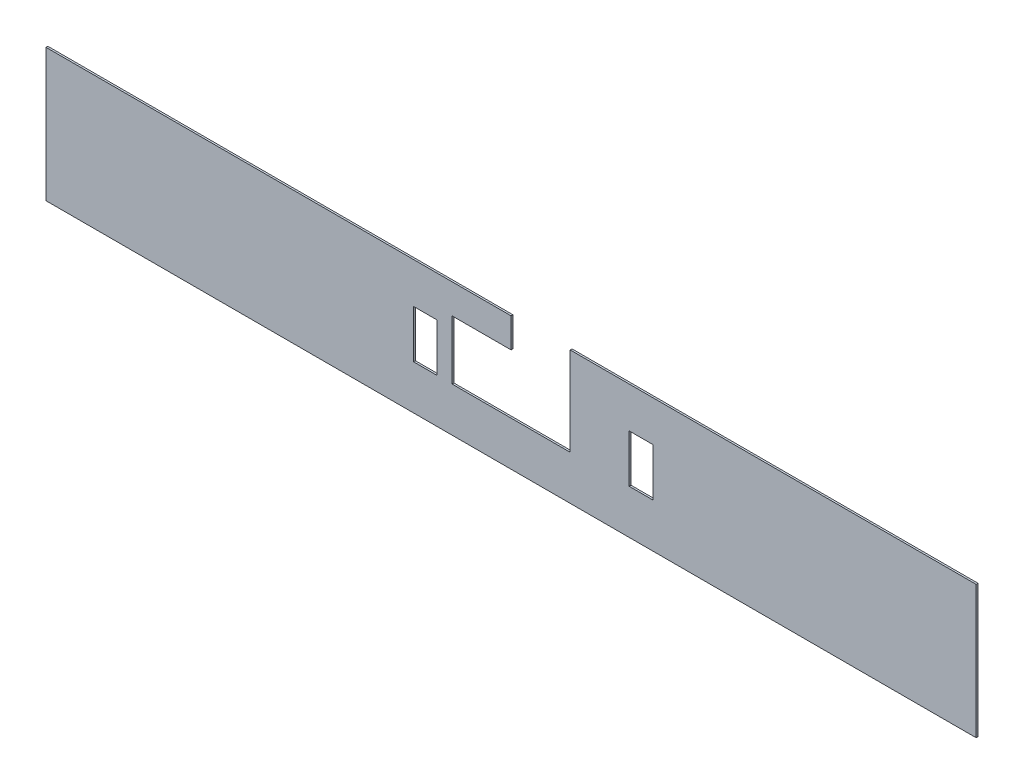
ISO-10303-21;
HEADER;
FILE_DESCRIPTION(('STEP AP214'),'2;1');
FILE_NAME('part.step','',(''),(''),'','','');
FILE_SCHEMA(('AUTOMOTIVE_DESIGN { 1 0 10303 214 1 1 1 1 }'));
ENDSEC;
DATA;
#1=APPLICATION_CONTEXT('core data for automotive mechanical design processes');
#2=APPLICATION_PROTOCOL_DEFINITION('international standard','automotive_design',2000,#1);
#3=PRODUCT_CONTEXT('',#1,'mechanical');
#4=PRODUCT('Part','Part','',(#3));
#5=PRODUCT_RELATED_PRODUCT_CATEGORY('part','',(#4));
#6=PRODUCT_DEFINITION_FORMATION('','',#4);
#7=PRODUCT_DEFINITION_CONTEXT('part definition',#1,'design');
#8=PRODUCT_DEFINITION('design','',#6,#7);
#9=PRODUCT_DEFINITION_SHAPE('','',#8);
#10=(LENGTH_UNIT() NAMED_UNIT(*) SI_UNIT(.MILLI.,.METRE.));
#11=(NAMED_UNIT(*) PLANE_ANGLE_UNIT() SI_UNIT($,.RADIAN.));
#12=(NAMED_UNIT(*) SI_UNIT($,.STERADIAN.) SOLID_ANGLE_UNIT());
#13=UNCERTAINTY_MEASURE_WITH_UNIT(LENGTH_MEASURE(1.E-05),#10,'distance_accuracy_value','');
#14=(GEOMETRIC_REPRESENTATION_CONTEXT(3) GLOBAL_UNCERTAINTY_ASSIGNED_CONTEXT((#13)) GLOBAL_UNIT_ASSIGNED_CONTEXT((#10,
#11,#12)) REPRESENTATION_CONTEXT('',''));
#15=CARTESIAN_POINT('',(0.,0.,0.));
#16=DIRECTION('',(0.,0.,1.));
#17=DIRECTION('',(1.,0.,0.));
#18=AXIS2_PLACEMENT_3D('',#15,#16,#17);
#19=CARTESIAN_POINT('',(0.,0.,1.6002));
#20=DIRECTION('',(0.,0.,1.));
#21=DIRECTION('',(1.,0.,0.));
#22=AXIS2_PLACEMENT_3D('',#19,#20,#21);
#23=PLANE('',#22);
#24=DIRECTION('',(-1.,0.,0.));
#25=VECTOR('',#24,1.);
#26=CARTESIAN_POINT('',(0.,50.8,1.6002));
#27=LINE('',#26,#25);
#28=CARTESIAN_POINT('',(0.,50.8,1.6002));
#29=VERTEX_POINT('',#28);
#30=CARTESIAN_POINT('',(-50.8,50.8,1.6002));
#31=VERTEX_POINT('',#30);
#32=EDGE_CURVE('E191',#29,#31,#27,.T.);
#33=ORIENTED_EDGE('',*,*,#32,.F.);
#34=DIRECTION('',(0.,-1.,0.));
#35=VECTOR('',#34,1.);
#36=CARTESIAN_POINT('',(0.,76.2,1.6002));
#37=LINE('',#36,#35);
#38=CARTESIAN_POINT('',(0.,76.2,1.6002));
#39=VERTEX_POINT('',#38);
#40=EDGE_CURVE('E271',#39,#29,#37,.T.);
#41=ORIENTED_EDGE('',*,*,#40,.F.);
#42=DIRECTION('',(1.,0.,0.));
#43=VECTOR('',#42,1.);
#44=CARTESIAN_POINT('',(-400.05,76.2,1.6002));
#45=LINE('',#44,#43);
#46=CARTESIAN_POINT('',(-400.05,76.2,1.6002));
#47=VERTEX_POINT('',#46);
#48=EDGE_CURVE('E268',#47,#39,#45,.T.);
#49=ORIENTED_EDGE('',*,*,#48,.F.);
#50=DIRECTION('',(0.,1.,0.));
#51=VECTOR('',#50,1.);
#52=CARTESIAN_POINT('',(-400.05,-38.1000000000001,1.6002));
#53=LINE('',#52,#51);
#54=CARTESIAN_POINT('',(-400.05,-38.1000000000001,1.6002));
#55=VERTEX_POINT('',#54);
#56=EDGE_CURVE('E265',#55,#47,#53,.T.);
#57=ORIENTED_EDGE('',*,*,#56,.F.);
#58=DIRECTION('',(-1.,0.,0.));
#59=VECTOR('',#58,1.);
#60=CARTESIAN_POINT('',(400.05,-38.1,1.6002));
#61=LINE('',#60,#59);
#62=CARTESIAN_POINT('',(400.05,-38.1,1.6002));
#63=VERTEX_POINT('',#62);
#64=EDGE_CURVE('E262',#63,#55,#61,.T.);
#65=ORIENTED_EDGE('',*,*,#64,.F.);
#66=DIRECTION('',(0.,-1.,0.));
#67=VECTOR('',#66,1.);
#68=CARTESIAN_POINT('',(400.05,76.2,1.6002));
#69=LINE('',#68,#67);
#70=CARTESIAN_POINT('',(400.05,76.2,1.6002));
#71=VERTEX_POINT('',#70);
#72=EDGE_CURVE('E259',#71,#63,#69,.T.);
#73=ORIENTED_EDGE('',*,*,#72,.F.);
#74=DIRECTION('',(1.,0.,0.));
#75=VECTOR('',#74,1.);
#76=CARTESIAN_POINT('',(50.8,76.2,1.6002));
#77=LINE('',#76,#75);
#78=CARTESIAN_POINT('',(50.8,76.2,1.6002));
#79=VERTEX_POINT('',#78);
#80=EDGE_CURVE('E256',#79,#71,#77,.T.);
#81=ORIENTED_EDGE('',*,*,#80,.F.);
#82=DIRECTION('',(0.,1.,0.));
#83=VECTOR('',#82,1.);
#84=CARTESIAN_POINT('',(50.8,0.,1.6002));
#85=LINE('',#84,#83);
#86=CARTESIAN_POINT('',(50.8,0.,1.6002));
#87=VERTEX_POINT('',#86);
#88=EDGE_CURVE('E252',#87,#79,#85,.T.);
#89=ORIENTED_EDGE('',*,*,#88,.F.);
#90=DIRECTION('',(1.,0.,0.));
#91=VECTOR('',#90,1.);
#92=CARTESIAN_POINT('',(0.,0.,1.6002));
#93=LINE('',#92,#91);
#94=CARTESIAN_POINT('',(-50.8,0.,1.6002));
#95=VERTEX_POINT('',#94);
#96=EDGE_CURVE('E250',#95,#87,#93,.T.);
#97=ORIENTED_EDGE('',*,*,#96,.F.);
#98=DIRECTION('',(0.,-1.,0.));
#99=VECTOR('',#98,1.);
#100=CARTESIAN_POINT('',(-50.8,0.,1.6002));
#101=LINE('',#100,#99);
#102=EDGE_CURVE('E181',#31,#95,#101,.T.);
#103=ORIENTED_EDGE('',*,*,#102,.F.);
#104=EDGE_LOOP('',(#33,#41,#49,#57,#65,#73,#81,#89,#97,#103));
#105=FACE_BOUND('',#104,.T.);
#106=DIRECTION('',(-1.,0.,0.));
#107=VECTOR('',#106,1.);
#108=CARTESIAN_POINT('',(-83.82,41.275,1.6002));
#109=LINE('',#108,#107);
#110=CARTESIAN_POINT('',(-63.5,41.275,1.6002));
#111=VERTEX_POINT('',#110);
#112=CARTESIAN_POINT('',(-83.82,41.275,1.6002));
#113=VERTEX_POINT('',#112);
#114=EDGE_CURVE('E223',#111,#113,#109,.T.);
#115=ORIENTED_EDGE('',*,*,#114,.F.);
#116=DIRECTION('',(0.,1.,0.));
#117=VECTOR('',#116,1.);
#118=CARTESIAN_POINT('',(-63.5,41.275,1.6002));
#119=LINE('',#118,#117);
#120=CARTESIAN_POINT('',(-63.5,0.,1.6002));
#121=VERTEX_POINT('',#120);
#122=EDGE_CURVE('E221',#121,#111,#119,.T.);
#123=ORIENTED_EDGE('',*,*,#122,.F.);
#124=DIRECTION('',(1.,0.,0.));
#125=VECTOR('',#124,1.);
#126=CARTESIAN_POINT('',(-83.82,0.,1.6002));
#127=LINE('',#126,#125);
#128=CARTESIAN_POINT('',(-83.82,0.,1.6002));
#129=VERTEX_POINT('',#128);
#130=EDGE_CURVE('E229',#129,#121,#127,.T.);
#131=ORIENTED_EDGE('',*,*,#130,.F.);
#132=DIRECTION('',(0.,-1.,0.));
#133=VECTOR('',#132,1.);
#134=CARTESIAN_POINT('',(-83.82,41.275,1.6002));
#135=LINE('',#134,#133);
#136=EDGE_CURVE('E226',#113,#129,#135,.T.);
#137=ORIENTED_EDGE('',*,*,#136,.F.);
#138=EDGE_LOOP('',(#115,#123,#131,#137));
#139=FACE_BOUND('',#138,.T.);
#140=DIRECTION('',(-1.,0.,0.));
#141=VECTOR('',#140,1.);
#142=CARTESIAN_POINT('',(101.6,41.275,1.6002));
#143=LINE('',#142,#141);
#144=CARTESIAN_POINT('',(121.92,41.275,1.6002));
#145=VERTEX_POINT('',#144);
#146=CARTESIAN_POINT('',(101.6,41.275,1.6002));
#147=VERTEX_POINT('',#146);
#148=EDGE_CURVE('E197',#145,#147,#143,.T.);
#149=ORIENTED_EDGE('',*,*,#148,.F.);
#150=DIRECTION('',(0.,1.,0.));
#151=VECTOR('',#150,1.);
#152=CARTESIAN_POINT('',(121.92,41.275,1.6002));
#153=LINE('',#152,#151);
#154=CARTESIAN_POINT('',(121.92,0.,1.6002));
#155=VERTEX_POINT('',#154);
#156=EDGE_CURVE('E195',#155,#145,#153,.T.);
#157=ORIENTED_EDGE('',*,*,#156,.F.);
#158=DIRECTION('',(1.,0.,0.));
#159=VECTOR('',#158,1.);
#160=CARTESIAN_POINT('',(101.6,0.,1.6002));
#161=LINE('',#160,#159);
#162=CARTESIAN_POINT('',(101.6,0.,1.6002));
#163=VERTEX_POINT('',#162);
#164=EDGE_CURVE('E202',#163,#155,#161,.T.);
#165=ORIENTED_EDGE('',*,*,#164,.F.);
#166=DIRECTION('',(0.,-1.,0.));
#167=VECTOR('',#166,1.);
#168=CARTESIAN_POINT('',(101.6,41.275,1.6002));
#169=LINE('',#168,#167);
#170=EDGE_CURVE('E200',#147,#163,#169,.T.);
#171=ORIENTED_EDGE('',*,*,#170,.F.);
#172=EDGE_LOOP('',(#149,#157,#165,#171));
#173=FACE_BOUND('',#172,.T.);
#174=ADVANCED_FACE('F35',(#105,#139,#173),#23,.T.);
#175=CARTESIAN_POINT('',(0.,0.,0.));
#176=DIRECTION('',(0.,0.,1.));
#177=DIRECTION('',(1.,0.,0.));
#178=AXIS2_PLACEMENT_3D('',#175,#176,#177);
#179=PLANE('',#178);
#180=DIRECTION('',(0.,1.,0.));
#181=VECTOR('',#180,1.);
#182=CARTESIAN_POINT('',(-63.5,41.275,0.));
#183=LINE('',#182,#181);
#184=CARTESIAN_POINT('',(-63.5,0.,0.));
#185=VERTEX_POINT('',#184);
#186=CARTESIAN_POINT('',(-63.5,41.275,0.));
#187=VERTEX_POINT('',#186);
#188=EDGE_CURVE('E220',#185,#187,#183,.T.);
#189=ORIENTED_EDGE('',*,*,#188,.T.);
#190=DIRECTION('',(-1.,0.,0.));
#191=VECTOR('',#190,1.);
#192=CARTESIAN_POINT('',(-83.82,41.275,0.));
#193=LINE('',#192,#191);
#194=CARTESIAN_POINT('',(-83.82,41.275,0.));
#195=VERTEX_POINT('',#194);
#196=EDGE_CURVE('E234',#187,#195,#193,.T.);
#197=ORIENTED_EDGE('',*,*,#196,.T.);
#198=DIRECTION('',(0.,-1.,0.));
#199=VECTOR('',#198,1.);
#200=CARTESIAN_POINT('',(-83.82,41.275,0.));
#201=LINE('',#200,#199);
#202=CARTESIAN_POINT('',(-83.82,0.,0.));
#203=VERTEX_POINT('',#202);
#204=EDGE_CURVE('E237',#195,#203,#201,.T.);
#205=ORIENTED_EDGE('',*,*,#204,.T.);
#206=DIRECTION('',(1.,0.,0.));
#207=VECTOR('',#206,1.);
#208=CARTESIAN_POINT('',(-83.82,0.,0.));
#209=LINE('',#208,#207);
#210=EDGE_CURVE('E224',#203,#185,#209,.T.);
#211=ORIENTED_EDGE('',*,*,#210,.T.);
#212=EDGE_LOOP('',(#189,#197,#205,#211));
#213=FACE_BOUND('',#212,.T.);
#214=DIRECTION('',(0.,-1.,0.));
#215=VECTOR('',#214,1.);
#216=CARTESIAN_POINT('',(0.,76.2,0.));
#217=LINE('',#216,#215);
#218=CARTESIAN_POINT('',(0.,76.2,0.));
#219=VERTEX_POINT('',#218);
#220=CARTESIAN_POINT('',(0.,50.8,0.));
#221=VERTEX_POINT('',#220);
#222=EDGE_CURVE('E253',#219,#221,#217,.T.);
#223=ORIENTED_EDGE('',*,*,#222,.T.);
#224=DIRECTION('',(1.,0.,0.));
#225=VECTOR('',#224,1.);
#226=CARTESIAN_POINT('',(0.,50.8,0.));
#227=LINE('',#226,#225);
#228=CARTESIAN_POINT('',(-50.8,50.8,0.));
#229=VERTEX_POINT('',#228);
#230=EDGE_CURVE('E183',#229,#221,#227,.T.);
#231=ORIENTED_EDGE('',*,*,#230,.F.);
#232=DIRECTION('',(0.,1.,0.));
#233=VECTOR('',#232,1.);
#234=CARTESIAN_POINT('',(-50.8,0.,0.));
#235=LINE('',#234,#233);
#236=CARTESIAN_POINT('',(-50.8,0.,0.));
#237=VERTEX_POINT('',#236);
#238=EDGE_CURVE('E178',#237,#229,#235,.T.);
#239=ORIENTED_EDGE('',*,*,#238,.F.);
#240=DIRECTION('',(1.,0.,0.));
#241=VECTOR('',#240,1.);
#242=CARTESIAN_POINT('',(0.,0.,0.));
#243=LINE('',#242,#241);
#244=CARTESIAN_POINT('',(50.8,0.,0.));
#245=VERTEX_POINT('',#244);
#246=EDGE_CURVE('E161',#237,#245,#243,.T.);
#247=ORIENTED_EDGE('',*,*,#246,.T.);
#248=DIRECTION('',(0.,1.,0.));
#249=VECTOR('',#248,1.);
#250=CARTESIAN_POINT('',(50.8,0.,0.));
#251=LINE('',#250,#249);
#252=CARTESIAN_POINT('',(50.8,76.2,0.));
#253=VERTEX_POINT('',#252);
#254=EDGE_CURVE('E170',#245,#253,#251,.T.);
#255=ORIENTED_EDGE('',*,*,#254,.T.);
#256=DIRECTION('',(1.,0.,0.));
#257=VECTOR('',#256,1.);
#258=CARTESIAN_POINT('',(50.8,76.2,0.));
#259=LINE('',#258,#257);
#260=CARTESIAN_POINT('',(400.05,76.2,0.));
#261=VERTEX_POINT('',#260);
#262=EDGE_CURVE('E275',#253,#261,#259,.T.);
#263=ORIENTED_EDGE('',*,*,#262,.T.);
#264=DIRECTION('',(0.,-1.,0.));
#265=VECTOR('',#264,1.);
#266=CARTESIAN_POINT('',(400.05,76.2,0.));
#267=LINE('',#266,#265);
#268=CARTESIAN_POINT('',(400.05,-38.1,0.));
#269=VERTEX_POINT('',#268);
#270=EDGE_CURVE('E278',#261,#269,#267,.T.);
#271=ORIENTED_EDGE('',*,*,#270,.T.);
#272=DIRECTION('',(-1.,0.,0.));
#273=VECTOR('',#272,1.);
#274=CARTESIAN_POINT('',(400.05,-38.1,0.));
#275=LINE('',#274,#273);
#276=CARTESIAN_POINT('',(-400.05,-38.1000000000001,0.));
#277=VERTEX_POINT('',#276);
#278=EDGE_CURVE('E281',#269,#277,#275,.T.);
#279=ORIENTED_EDGE('',*,*,#278,.T.);
#280=DIRECTION('',(0.,1.,0.));
#281=VECTOR('',#280,1.);
#282=CARTESIAN_POINT('',(-400.05,-38.1000000000001,0.));
#283=LINE('',#282,#281);
#284=CARTESIAN_POINT('',(-400.05,76.2,0.));
#285=VERTEX_POINT('',#284);
#286=EDGE_CURVE('E284',#277,#285,#283,.T.);
#287=ORIENTED_EDGE('',*,*,#286,.T.);
#288=DIRECTION('',(1.,0.,0.));
#289=VECTOR('',#288,1.);
#290=CARTESIAN_POINT('',(-400.05,76.2,0.));
#291=LINE('',#290,#289);
#292=EDGE_CURVE('E287',#285,#219,#291,.T.);
#293=ORIENTED_EDGE('',*,*,#292,.T.);
#294=EDGE_LOOP('',(#223,#231,#239,#247,#255,#263,#271,#279,#287,#293));
#295=FACE_BOUND('',#294,.T.);
#296=DIRECTION('',(0.,1.,0.));
#297=VECTOR('',#296,1.);
#298=CARTESIAN_POINT('',(121.92,41.275,0.));
#299=LINE('',#298,#297);
#300=CARTESIAN_POINT('',(121.92,0.,0.));
#301=VERTEX_POINT('',#300);
#302=CARTESIAN_POINT('',(121.92,41.275,0.));
#303=VERTEX_POINT('',#302);
#304=EDGE_CURVE('E58',#301,#303,#299,.T.);
#305=ORIENTED_EDGE('',*,*,#304,.T.);
#306=DIRECTION('',(-1.,0.,0.));
#307=VECTOR('',#306,1.);
#308=CARTESIAN_POINT('',(101.6,41.275,0.));
#309=LINE('',#308,#307);
#310=CARTESIAN_POINT('',(101.6,41.275,0.));
#311=VERTEX_POINT('',#310);
#312=EDGE_CURVE('E206',#303,#311,#309,.T.);
#313=ORIENTED_EDGE('',*,*,#312,.T.);
#314=DIRECTION('',(0.,-1.,0.));
#315=VECTOR('',#314,1.);
#316=CARTESIAN_POINT('',(101.6,41.275,0.));
#317=LINE('',#316,#315);
#318=CARTESIAN_POINT('',(101.6,0.,0.));
#319=VERTEX_POINT('',#318);
#320=EDGE_CURVE('E209',#311,#319,#317,.T.);
#321=ORIENTED_EDGE('',*,*,#320,.T.);
#322=DIRECTION('',(1.,0.,0.));
#323=VECTOR('',#322,1.);
#324=CARTESIAN_POINT('',(101.6,0.,0.));
#325=LINE('',#324,#323);
#326=EDGE_CURVE('E198',#319,#301,#325,.T.);
#327=ORIENTED_EDGE('',*,*,#326,.T.);
#328=EDGE_LOOP('',(#305,#313,#321,#327));
#329=FACE_BOUND('',#328,.T.);
#330=ADVANCED_FACE('F186',(#213,#295,#329),#179,.F.);
#331=CARTESIAN_POINT('',(0.,0.,1.6002));
#332=DIRECTION('',(0.,1.,0.));
#333=DIRECTION('',(0.,0.,1.));
#334=AXIS2_PLACEMENT_3D('',#331,#332,#333);
#335=PLANE('',#334);
#336=ORIENTED_EDGE('',*,*,#246,.F.);
#337=DIRECTION('',(0.,0.,-1.));
#338=VECTOR('',#337,1.);
#339=CARTESIAN_POINT('',(-50.8,0.,2.54));
#340=LINE('',#339,#338);
#341=EDGE_CURVE('E164',#95,#237,#340,.T.);
#342=ORIENTED_EDGE('',*,*,#341,.F.);
#343=ORIENTED_EDGE('',*,*,#96,.T.);
#344=DIRECTION('',(0.,0.,-1.));
#345=VECTOR('',#344,1.);
#346=CARTESIAN_POINT('',(50.8,0.,1.6002));
#347=LINE('',#346,#345);
#348=EDGE_CURVE('E165',#87,#245,#347,.T.);
#349=ORIENTED_EDGE('',*,*,#348,.T.);
#350=EDGE_LOOP('',(#336,#342,#343,#349));
#351=FACE_BOUND('',#350,.T.);
#352=ADVANCED_FACE('F37',(#351),#335,.T.);
#353=CARTESIAN_POINT('',(0.,76.2,1.6002));
#354=DIRECTION('',(1.,0.,0.));
#355=DIRECTION('',(0.,1.,0.));
#356=AXIS2_PLACEMENT_3D('',#353,#354,#355);
#357=PLANE('',#356);
#358=DIRECTION('',(0.,0.,1.));
#359=VECTOR('',#358,1.);
#360=CARTESIAN_POINT('',(0.,50.8,1.6002));
#361=LINE('',#360,#359);
#362=EDGE_CURVE('E11',#221,#29,#361,.T.);
#363=ORIENTED_EDGE('',*,*,#362,.F.);
#364=ORIENTED_EDGE('',*,*,#222,.F.);
#365=DIRECTION('',(0.,0.,-1.));
#366=VECTOR('',#365,1.);
#367=CARTESIAN_POINT('',(0.,76.2,1.6002));
#368=LINE('',#367,#366);
#369=EDGE_CURVE('E43',#39,#219,#368,.T.);
#370=ORIENTED_EDGE('',*,*,#369,.F.);
#371=ORIENTED_EDGE('',*,*,#40,.T.);
#372=EDGE_LOOP('',(#363,#364,#370,#371));
#373=FACE_BOUND('',#372,.T.);
#374=ADVANCED_FACE('F325',(#373),#357,.T.);
#375=CARTESIAN_POINT('',(-400.05,76.2,1.6002));
#376=DIRECTION('',(0.,1.,0.));
#377=DIRECTION('',(0.,0.,1.));
#378=AXIS2_PLACEMENT_3D('',#375,#376,#377);
#379=PLANE('',#378);
#380=ORIENTED_EDGE('',*,*,#292,.F.);
#381=DIRECTION('',(0.,0.,-1.));
#382=VECTOR('',#381,1.);
#383=CARTESIAN_POINT('',(-400.05,76.2,1.6002));
#384=LINE('',#383,#382);
#385=EDGE_CURVE('E292',#47,#285,#384,.T.);
#386=ORIENTED_EDGE('',*,*,#385,.F.);
#387=ORIENTED_EDGE('',*,*,#48,.T.);
#388=ORIENTED_EDGE('',*,*,#369,.T.);
#389=EDGE_LOOP('',(#380,#386,#387,#388));
#390=FACE_BOUND('',#389,.T.);
#391=ADVANCED_FACE('F333',(#390),#379,.T.);
#392=CARTESIAN_POINT('',(-400.05,-38.1000000000001,1.6002));
#393=DIRECTION('',(-1.,0.,0.));
#394=DIRECTION('',(0.,0.,1.));
#395=AXIS2_PLACEMENT_3D('',#392,#393,#394);
#396=PLANE('',#395);
#397=ORIENTED_EDGE('',*,*,#286,.F.);
#398=DIRECTION('',(0.,0.,-1.));
#399=VECTOR('',#398,1.);
#400=CARTESIAN_POINT('',(-400.05,-38.1000000000001,1.6002));
#401=LINE('',#400,#399);
#402=EDGE_CURVE('E294',#55,#277,#401,.T.);
#403=ORIENTED_EDGE('',*,*,#402,.F.);
#404=ORIENTED_EDGE('',*,*,#56,.T.);
#405=ORIENTED_EDGE('',*,*,#385,.T.);
#406=EDGE_LOOP('',(#397,#403,#404,#405));
#407=FACE_BOUND('',#406,.T.);
#408=ADVANCED_FACE('F319',(#407),#396,.T.);
#409=CARTESIAN_POINT('',(400.05,-38.1,1.6002));
#410=DIRECTION('',(0.,-1.,0.));
#411=DIRECTION('',(1.,0.,0.));
#412=AXIS2_PLACEMENT_3D('',#409,#410,#411);
#413=PLANE('',#412);
#414=ORIENTED_EDGE('',*,*,#278,.F.);
#415=DIRECTION('',(0.,0.,-1.));
#416=VECTOR('',#415,1.);
#417=CARTESIAN_POINT('',(400.05,-38.1,1.6002));
#418=LINE('',#417,#416);
#419=EDGE_CURVE('E296',#63,#269,#418,.T.);
#420=ORIENTED_EDGE('',*,*,#419,.F.);
#421=ORIENTED_EDGE('',*,*,#64,.T.);
#422=ORIENTED_EDGE('',*,*,#402,.T.);
#423=EDGE_LOOP('',(#414,#420,#421,#422));
#424=FACE_BOUND('',#423,.T.);
#425=ADVANCED_FACE('F315',(#424),#413,.T.);
#426=CARTESIAN_POINT('',(400.05,76.2,1.6002));
#427=DIRECTION('',(1.,0.,0.));
#428=DIRECTION('',(0.,0.,-1.));
#429=AXIS2_PLACEMENT_3D('',#426,#427,#428);
#430=PLANE('',#429);
#431=ORIENTED_EDGE('',*,*,#270,.F.);
#432=DIRECTION('',(0.,0.,-1.));
#433=VECTOR('',#432,1.);
#434=CARTESIAN_POINT('',(400.05,76.2,1.6002));
#435=LINE('',#434,#433);
#436=EDGE_CURVE('E298',#71,#261,#435,.T.);
#437=ORIENTED_EDGE('',*,*,#436,.F.);
#438=ORIENTED_EDGE('',*,*,#72,.T.);
#439=ORIENTED_EDGE('',*,*,#419,.T.);
#440=EDGE_LOOP('',(#431,#437,#438,#439));
#441=FACE_BOUND('',#440,.T.);
#442=ADVANCED_FACE('F311',(#441),#430,.T.);
#443=CARTESIAN_POINT('',(50.8,76.2,1.6002));
#444=DIRECTION('',(0.,1.,0.));
#445=DIRECTION('',(0.,0.,1.));
#446=AXIS2_PLACEMENT_3D('',#443,#444,#445);
#447=PLANE('',#446);
#448=ORIENTED_EDGE('',*,*,#262,.F.);
#449=DIRECTION('',(0.,0.,-1.));
#450=VECTOR('',#449,1.);
#451=CARTESIAN_POINT('',(50.8,76.2,1.6002));
#452=LINE('',#451,#450);
#453=EDGE_CURVE('E300',#79,#253,#452,.T.);
#454=ORIENTED_EDGE('',*,*,#453,.F.);
#455=ORIENTED_EDGE('',*,*,#80,.T.);
#456=ORIENTED_EDGE('',*,*,#436,.T.);
#457=EDGE_LOOP('',(#448,#454,#455,#456));
#458=FACE_BOUND('',#457,.T.);
#459=ADVANCED_FACE('F307',(#458),#447,.T.);
#460=CARTESIAN_POINT('',(50.8,0.,1.6002));
#461=DIRECTION('',(-1.,0.,0.));
#462=DIRECTION('',(0.,-1.,0.));
#463=AXIS2_PLACEMENT_3D('',#460,#461,#462);
#464=PLANE('',#463);
#465=ORIENTED_EDGE('',*,*,#254,.F.);
#466=ORIENTED_EDGE('',*,*,#348,.F.);
#467=ORIENTED_EDGE('',*,*,#88,.T.);
#468=ORIENTED_EDGE('',*,*,#453,.T.);
#469=EDGE_LOOP('',(#465,#466,#467,#468));
#470=FACE_BOUND('',#469,.T.);
#471=ADVANCED_FACE('F303',(#470),#464,.T.);
#472=CARTESIAN_POINT('',(-63.5,41.275,1.6002));
#473=DIRECTION('',(-1.,0.,0.));
#474=DIRECTION('',(0.,-1.,0.));
#475=AXIS2_PLACEMENT_3D('',#472,#473,#474);
#476=PLANE('',#475);
#477=ORIENTED_EDGE('',*,*,#188,.F.);
#478=DIRECTION('',(0.,0.,-1.));
#479=VECTOR('',#478,1.);
#480=CARTESIAN_POINT('',(-63.5,0.,1.6002));
#481=LINE('',#480,#479);
#482=EDGE_CURVE('E231',#121,#185,#481,.T.);
#483=ORIENTED_EDGE('',*,*,#482,.F.);
#484=ORIENTED_EDGE('',*,*,#122,.T.);
#485=DIRECTION('',(0.,0.,-1.));
#486=VECTOR('',#485,1.);
#487=CARTESIAN_POINT('',(-63.5,41.275,1.6002));
#488=LINE('',#487,#486);
#489=EDGE_CURVE('E171',#111,#187,#488,.T.);
#490=ORIENTED_EDGE('',*,*,#489,.T.);
#491=EDGE_LOOP('',(#477,#483,#484,#490));
#492=FACE_BOUND('',#491,.T.);
#493=ADVANCED_FACE('F350',(#492),#476,.T.);
#494=CARTESIAN_POINT('',(-83.82,41.275,1.6002));
#495=DIRECTION('',(0.,-1.,0.));
#496=DIRECTION('',(0.,0.,-1.));
#497=AXIS2_PLACEMENT_3D('',#494,#495,#496);
#498=PLANE('',#497);
#499=ORIENTED_EDGE('',*,*,#196,.F.);
#500=ORIENTED_EDGE('',*,*,#489,.F.);
#501=ORIENTED_EDGE('',*,*,#114,.T.);
#502=DIRECTION('',(0.,0.,-1.));
#503=VECTOR('',#502,1.);
#504=CARTESIAN_POINT('',(-83.82,41.275,1.6002));
#505=LINE('',#504,#503);
#506=EDGE_CURVE('E246',#113,#195,#505,.T.);
#507=ORIENTED_EDGE('',*,*,#506,.T.);
#508=EDGE_LOOP('',(#499,#500,#501,#507));
#509=FACE_BOUND('',#508,.T.);
#510=ADVANCED_FACE('F353',(#509),#498,.T.);
#511=CARTESIAN_POINT('',(-83.82,41.275,1.6002));
#512=DIRECTION('',(1.,0.,0.));
#513=DIRECTION('',(0.,1.,0.));
#514=AXIS2_PLACEMENT_3D('',#511,#512,#513);
#515=PLANE('',#514);
#516=ORIENTED_EDGE('',*,*,#204,.F.);
#517=ORIENTED_EDGE('',*,*,#506,.F.);
#518=ORIENTED_EDGE('',*,*,#136,.T.);
#519=DIRECTION('',(0.,0.,-1.));
#520=VECTOR('',#519,1.);
#521=CARTESIAN_POINT('',(-83.82,0.,1.6002));
#522=LINE('',#521,#520);
#523=EDGE_CURVE('E244',#129,#203,#522,.T.);
#524=ORIENTED_EDGE('',*,*,#523,.T.);
#525=EDGE_LOOP('',(#516,#517,#518,#524));
#526=FACE_BOUND('',#525,.T.);
#527=ADVANCED_FACE('F357',(#526),#515,.T.);
#528=CARTESIAN_POINT('',(-83.82,0.,1.6002));
#529=DIRECTION('',(0.,1.,0.));
#530=DIRECTION('',(0.,0.,1.));
#531=AXIS2_PLACEMENT_3D('',#528,#529,#530);
#532=PLANE('',#531);
#533=ORIENTED_EDGE('',*,*,#210,.F.);
#534=ORIENTED_EDGE('',*,*,#523,.F.);
#535=ORIENTED_EDGE('',*,*,#130,.T.);
#536=ORIENTED_EDGE('',*,*,#482,.T.);
#537=EDGE_LOOP('',(#533,#534,#535,#536));
#538=FACE_BOUND('',#537,.T.);
#539=ADVANCED_FACE('F361',(#538),#532,.T.);
#540=CARTESIAN_POINT('',(121.92,41.275,1.6002));
#541=DIRECTION('',(-1.,0.,0.));
#542=DIRECTION('',(0.,0.,1.));
#543=AXIS2_PLACEMENT_3D('',#540,#541,#542);
#544=PLANE('',#543);
#545=ORIENTED_EDGE('',*,*,#304,.F.);
#546=DIRECTION('',(0.,0.,-1.));
#547=VECTOR('',#546,1.);
#548=CARTESIAN_POINT('',(121.92,0.,1.6002));
#549=LINE('',#548,#547);
#550=EDGE_CURVE('E204',#155,#301,#549,.T.);
#551=ORIENTED_EDGE('',*,*,#550,.F.);
#552=ORIENTED_EDGE('',*,*,#156,.T.);
#553=DIRECTION('',(0.,0.,-1.));
#554=VECTOR('',#553,1.);
#555=CARTESIAN_POINT('',(121.92,41.275,1.6002));
#556=LINE('',#555,#554);
#557=EDGE_CURVE('E218',#145,#303,#556,.T.);
#558=ORIENTED_EDGE('',*,*,#557,.T.);
#559=EDGE_LOOP('',(#545,#551,#552,#558));
#560=FACE_BOUND('',#559,.T.);
#561=ADVANCED_FACE('F365',(#560),#544,.T.);
#562=CARTESIAN_POINT('',(101.6,41.275,1.6002));
#563=DIRECTION('',(0.,-1.,0.));
#564=DIRECTION('',(0.,0.,-1.));
#565=AXIS2_PLACEMENT_3D('',#562,#563,#564);
#566=PLANE('',#565);
#567=ORIENTED_EDGE('',*,*,#312,.F.);
#568=ORIENTED_EDGE('',*,*,#557,.F.);
#569=ORIENTED_EDGE('',*,*,#148,.T.);
#570=DIRECTION('',(0.,0.,-1.));
#571=VECTOR('',#570,1.);
#572=CARTESIAN_POINT('',(101.6,41.275,1.6002));
#573=LINE('',#572,#571);
#574=EDGE_CURVE('E216',#147,#311,#573,.T.);
#575=ORIENTED_EDGE('',*,*,#574,.T.);
#576=EDGE_LOOP('',(#567,#568,#569,#575));
#577=FACE_BOUND('',#576,.T.);
#578=ADVANCED_FACE('F369',(#577),#566,.T.);
#579=CARTESIAN_POINT('',(101.6,41.275,1.6002));
#580=DIRECTION('',(1.,0.,0.));
#581=DIRECTION('',(0.,0.,-1.));
#582=AXIS2_PLACEMENT_3D('',#579,#580,#581);
#583=PLANE('',#582);
#584=ORIENTED_EDGE('',*,*,#320,.F.);
#585=ORIENTED_EDGE('',*,*,#574,.F.);
#586=ORIENTED_EDGE('',*,*,#170,.T.);
#587=DIRECTION('',(0.,0.,-1.));
#588=VECTOR('',#587,1.);
#589=CARTESIAN_POINT('',(101.6,0.,1.6002));
#590=LINE('',#589,#588);
#591=EDGE_CURVE('E50',#163,#319,#590,.T.);
#592=ORIENTED_EDGE('',*,*,#591,.T.);
#593=EDGE_LOOP('',(#584,#585,#586,#592));
#594=FACE_BOUND('',#593,.T.);
#595=ADVANCED_FACE('F372',(#594),#583,.T.);
#596=CARTESIAN_POINT('',(101.6,0.,1.6002));
#597=DIRECTION('',(0.,1.,0.));
#598=DIRECTION('',(0.,0.,1.));
#599=AXIS2_PLACEMENT_3D('',#596,#597,#598);
#600=PLANE('',#599);
#601=ORIENTED_EDGE('',*,*,#326,.F.);
#602=ORIENTED_EDGE('',*,*,#591,.F.);
#603=ORIENTED_EDGE('',*,*,#164,.T.);
#604=ORIENTED_EDGE('',*,*,#550,.T.);
#605=EDGE_LOOP('',(#601,#602,#603,#604));
#606=FACE_BOUND('',#605,.T.);
#607=ADVANCED_FACE('F376',(#606),#600,.T.);
#608=CARTESIAN_POINT('',(0.,50.8,2.54));
#609=DIRECTION('',(0.,1.,0.));
#610=DIRECTION('',(0.,0.,1.));
#611=AXIS2_PLACEMENT_3D('',#608,#609,#610);
#612=PLANE('',#611);
#613=ORIENTED_EDGE('',*,*,#32,.T.);
#614=DIRECTION('',(0.,0.,-1.));
#615=VECTOR('',#614,1.);
#616=CARTESIAN_POINT('',(-50.8,50.8,2.54));
#617=LINE('',#616,#615);
#618=EDGE_CURVE('E182',#31,#229,#617,.T.);
#619=ORIENTED_EDGE('',*,*,#618,.T.);
#620=ORIENTED_EDGE('',*,*,#230,.T.);
#621=ORIENTED_EDGE('',*,*,#362,.T.);
#622=EDGE_LOOP('',(#613,#619,#620,#621));
#623=FACE_BOUND('',#622,.T.);
#624=ADVANCED_FACE('F329',(#623),#612,.F.);
#625=CARTESIAN_POINT('',(-50.8,0.,2.54));
#626=DIRECTION('',(-1.,0.,0.));
#627=DIRECTION('',(0.,0.,1.));
#628=AXIS2_PLACEMENT_3D('',#625,#626,#627);
#629=PLANE('',#628);
#630=ORIENTED_EDGE('',*,*,#102,.T.);
#631=ORIENTED_EDGE('',*,*,#341,.T.);
#632=ORIENTED_EDGE('',*,*,#238,.T.);
#633=ORIENTED_EDGE('',*,*,#618,.F.);
#634=EDGE_LOOP('',(#630,#631,#632,#633));
#635=FACE_BOUND('',#634,.T.);
#636=ADVANCED_FACE('F176',(#635),#629,.F.);
#637=CLOSED_SHELL('',(#174,#330,#352,#374,#391,#408,#425,#442,#459,#471,#493,#510,#527,#539,
#561,#578,#595,#607,#624,#636));
#638=MANIFOLD_SOLID_BREP('B2',#637);
#639=ADVANCED_BREP_SHAPE_REPRESENTATION('',(#18,#638),#14);
#640=SHAPE_DEFINITION_REPRESENTATION(#9,#639);
ENDSEC;
END-ISO-10303-21;
